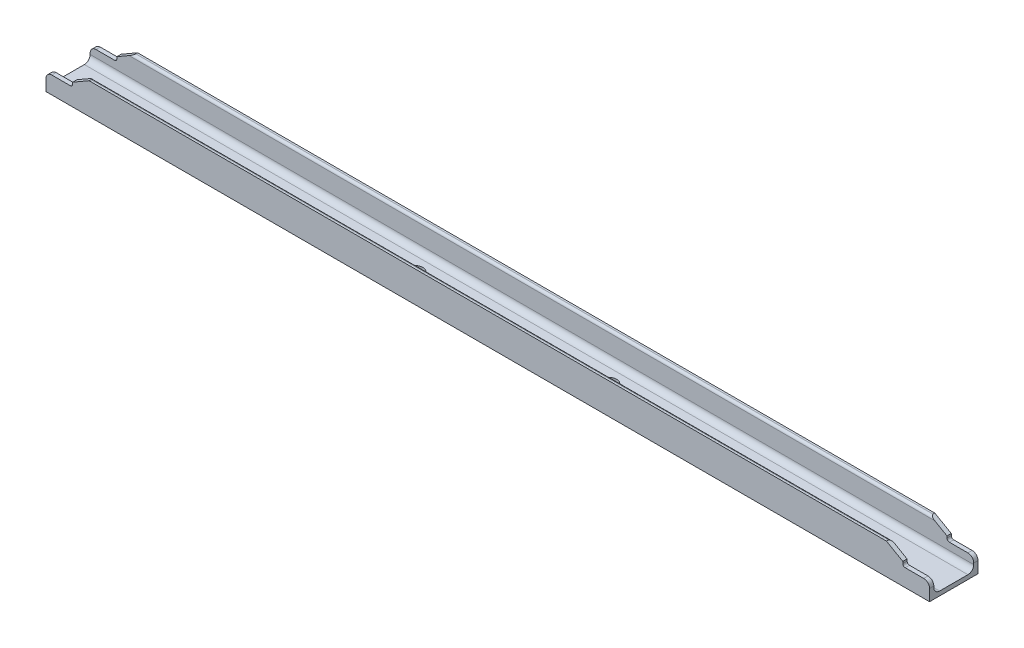
ISO-10303-21;
HEADER;
FILE_DESCRIPTION(('STEP AP214'),'2;1');
FILE_NAME('part.step','',(''),(''),'','','');
FILE_SCHEMA(('AUTOMOTIVE_DESIGN { 1 0 10303 214 1 1 1 1 }'));
ENDSEC;
DATA;
#1=APPLICATION_CONTEXT('core data for automotive mechanical design processes');
#2=APPLICATION_PROTOCOL_DEFINITION('international standard','automotive_design',2000,#1);
#3=PRODUCT_CONTEXT('',#1,'mechanical');
#4=PRODUCT('Part','Part','',(#3));
#5=PRODUCT_RELATED_PRODUCT_CATEGORY('part','',(#4));
#6=PRODUCT_DEFINITION_FORMATION('','',#4);
#7=PRODUCT_DEFINITION_CONTEXT('part definition',#1,'design');
#8=PRODUCT_DEFINITION('design','',#6,#7);
#9=PRODUCT_DEFINITION_SHAPE('','',#8);
#10=(LENGTH_UNIT() NAMED_UNIT(*) SI_UNIT(.MILLI.,.METRE.));
#11=(NAMED_UNIT(*) PLANE_ANGLE_UNIT() SI_UNIT($,.RADIAN.));
#12=(NAMED_UNIT(*) SI_UNIT($,.STERADIAN.) SOLID_ANGLE_UNIT());
#13=UNCERTAINTY_MEASURE_WITH_UNIT(LENGTH_MEASURE(1.E-05),#10,'distance_accuracy_value','');
#14=(GEOMETRIC_REPRESENTATION_CONTEXT(3) GLOBAL_UNCERTAINTY_ASSIGNED_CONTEXT((#13)) GLOBAL_UNIT_ASSIGNED_CONTEXT((#10,
#11,#12)) REPRESENTATION_CONTEXT('',''));
#15=CARTESIAN_POINT('',(0.,0.,0.));
#16=DIRECTION('',(0.,0.,1.));
#17=DIRECTION('',(1.,0.,0.));
#18=AXIS2_PLACEMENT_3D('',#15,#16,#17);
#19=CARTESIAN_POINT('',(-456.000000000001,-28.15,409.363288318623));
#20=DIRECTION('',(-1.,0.,0.));
#21=DIRECTION('',(0.,0.,1.));
#22=AXIS2_PLACEMENT_3D('',#19,#20,#21);
#23=PLANE('',#22);
#24=DIRECTION('',(0.,-1.,0.));
#25=VECTOR('',#24,1.);
#26=CARTESIAN_POINT('',(-456.000000000001,-39.9900000000004,25.));
#27=LINE('',#26,#25);
#28=CARTESIAN_POINT('',(-456.000000000001,-28.15,25.));
#29=VERTEX_POINT('',#28);
#30=CARTESIAN_POINT('',(-456.000000000001,-39.9900000000004,25.));
#31=VERTEX_POINT('',#30);
#32=EDGE_CURVE('E49',#29,#31,#27,.T.);
#33=ORIENTED_EDGE('',*,*,#32,.F.);
#34=DIRECTION('',(0.,0.,-1.));
#35=VECTOR('',#34,1.);
#36=CARTESIAN_POINT('',(-456.000000000001,-28.15,409.363288318623));
#37=LINE('',#36,#35);
#38=CARTESIAN_POINT('',(-456.000000000001,-28.15,20.6));
#39=VERTEX_POINT('',#38);
#40=EDGE_CURVE('E191',#29,#39,#37,.T.);
#41=ORIENTED_EDGE('',*,*,#40,.T.);
#42=DIRECTION('',(0.,1.,0.));
#43=VECTOR('',#42,1.);
#44=CARTESIAN_POINT('',(-456.000000000001,-10.4900000000004,20.6));
#45=LINE('',#44,#43);
#46=CARTESIAN_POINT('',(-456.000000000001,-29.5900000000004,20.6));
#47=VERTEX_POINT('',#46);
#48=EDGE_CURVE('E121',#47,#39,#45,.T.);
#49=ORIENTED_EDGE('',*,*,#48,.F.);
#50=CARTESIAN_POINT('',(-456.000000000001,-29.5900000000004,14.6));
#51=DIRECTION('',(-1.,0.,0.));
#52=DIRECTION('',(0.,0.,1.));
#53=AXIS2_PLACEMENT_3D('',#50,#51,#52);
#54=CIRCLE('',#53,6.);
#55=CARTESIAN_POINT('',(-456.000000000001,-35.5900000000004,14.6));
#56=VERTEX_POINT('',#55);
#57=EDGE_CURVE('E81',#56,#47,#54,.T.);
#58=ORIENTED_EDGE('',*,*,#57,.F.);
#59=DIRECTION('',(0.,0.,1.));
#60=VECTOR('',#59,1.);
#61=CARTESIAN_POINT('',(-456.000000000001,-35.5900000000004,14.6));
#62=LINE('',#61,#60);
#63=CARTESIAN_POINT('',(-456.000000000001,-35.5900000000004,-14.6));
#64=VERTEX_POINT('',#63);
#65=EDGE_CURVE('E74',#64,#56,#62,.T.);
#66=ORIENTED_EDGE('',*,*,#65,.F.);
#67=CARTESIAN_POINT('',(-456.000000000001,-29.5900000000004,-14.6));
#68=DIRECTION('',(-1.,0.,0.));
#69=DIRECTION('',(0.,0.,1.));
#70=AXIS2_PLACEMENT_3D('',#67,#68,#69);
#71=CIRCLE('',#70,6.);
#72=CARTESIAN_POINT('',(-456.000000000001,-29.5900000000003,-20.6));
#73=VERTEX_POINT('',#72);
#74=EDGE_CURVE('E78',#73,#64,#71,.T.);
#75=ORIENTED_EDGE('',*,*,#74,.F.);
#76=DIRECTION('',(0.,-1.,0.));
#77=VECTOR('',#76,1.);
#78=CARTESIAN_POINT('',(-456.000000000001,-10.4900000000004,-20.6));
#79=LINE('',#78,#77);
#80=CARTESIAN_POINT('',(-456.000000000001,-28.15,-20.6));
#81=VERTEX_POINT('',#80);
#82=EDGE_CURVE('E103',#81,#73,#79,.T.);
#83=ORIENTED_EDGE('',*,*,#82,.F.);
#84=CARTESIAN_POINT('',(-456.000000000001,-28.15,-25.));
#85=VERTEX_POINT('',#84);
#86=EDGE_CURVE('E331',#81,#85,#37,.T.);
#87=ORIENTED_EDGE('',*,*,#86,.T.);
#88=DIRECTION('',(0.,1.,0.));
#89=VECTOR('',#88,1.);
#90=CARTESIAN_POINT('',(-456.000000000001,-39.9900000000004,-25.));
#91=LINE('',#90,#89);
#92=CARTESIAN_POINT('',(-456.000000000001,-39.9900000000004,-25.));
#93=VERTEX_POINT('',#92);
#94=EDGE_CURVE('E57',#93,#85,#91,.T.);
#95=ORIENTED_EDGE('',*,*,#94,.F.);
#96=DIRECTION('',(0.,0.,-1.));
#97=VECTOR('',#96,1.);
#98=CARTESIAN_POINT('',(-456.000000000001,-39.9900000000004,-25.));
#99=LINE('',#98,#97);
#100=EDGE_CURVE('E135',#31,#93,#99,.T.);
#101=ORIENTED_EDGE('',*,*,#100,.F.);
#102=EDGE_LOOP('',(#33,#41,#49,#58,#66,#75,#83,#87,#95,#101));
#103=FACE_BOUND('',#102,.T.);
#104=ADVANCED_FACE('F36',(#103),#23,.T.);
#105=CARTESIAN_POINT('',(-515.363288318624,-39.9900000000004,-25.));
#106=DIRECTION('',(0.,0.,-1.));
#107=DIRECTION('',(-1.,0.,0.));
#108=AXIS2_PLACEMENT_3D('',#105,#106,#107);
#109=PLANE('',#108);
#110=DIRECTION('',(0.866025403784442,0.499999999999995,0.));
#111=VECTOR('',#110,1.);
#112=CARTESIAN_POINT('',(-411.495184118129,-7.99000000000037,-25.));
#113=LINE('',#112,#111);
#114=CARTESIAN_POINT('',(-428.400000000001,-17.7499999999999,-25.));
#115=VERTEX_POINT('',#114);
#116=CARTESIAN_POINT('',(-411.495184118129,-7.99000000000037,-25.));
#117=VERTEX_POINT('',#116);
#118=EDGE_CURVE('E388',#115,#117,#113,.T.);
#119=ORIENTED_EDGE('',*,*,#118,.T.);
#120=DIRECTION('',(1.,0.,0.));
#121=VECTOR('',#120,1.);
#122=CARTESIAN_POINT('',(-515.363288318624,-7.99000000000037,-25.));
#123=LINE('',#122,#121);
#124=CARTESIAN_POINT('',(411.495184118129,-7.99000000000037,-25.));
#125=VERTEX_POINT('',#124);
#126=EDGE_CURVE('E110',#117,#125,#123,.T.);
#127=ORIENTED_EDGE('',*,*,#126,.T.);
#128=DIRECTION('',(-0.866025403784442,0.499999999999995,0.));
#129=VECTOR('',#128,1.);
#130=CARTESIAN_POINT('',(411.495184118129,-7.99000000000037,-25.));
#131=LINE('',#130,#129);
#132=CARTESIAN_POINT('',(428.400000000001,-17.7499999999999,-25.));
#133=VERTEX_POINT('',#132);
#134=EDGE_CURVE('E543',#133,#125,#131,.T.);
#135=ORIENTED_EDGE('',*,*,#134,.F.);
#136=DIRECTION('',(0.,1.,0.));
#137=VECTOR('',#136,1.);
#138=CARTESIAN_POINT('',(428.400000000001,-39.9900000000004,-25.));
#139=LINE('',#138,#137);
#140=CARTESIAN_POINT('',(428.400000000001,-19.6499999999999,-25.));
#141=VERTEX_POINT('',#140);
#142=EDGE_CURVE('E478',#141,#133,#139,.T.);
#143=ORIENTED_EDGE('',*,*,#142,.F.);
#144=CARTESIAN_POINT('',(430.900000000001,-19.6499999999999,-25.));
#145=DIRECTION('',(0.,0.,1.));
#146=DIRECTION('',(1.,0.,0.));
#147=AXIS2_PLACEMENT_3D('',#144,#145,#146);
#148=CIRCLE('',#147,2.5);
#149=CARTESIAN_POINT('',(430.900000000001,-22.1499999999999,-25.));
#150=VERTEX_POINT('',#149);
#151=EDGE_CURVE('E471',#150,#141,#148,.F.);
#152=ORIENTED_EDGE('',*,*,#151,.F.);
#153=DIRECTION('',(-1.,0.,0.));
#154=VECTOR('',#153,1.);
#155=CARTESIAN_POINT('',(515.363288318624,-22.1499999999999,-25.));
#156=LINE('',#155,#154);
#157=CARTESIAN_POINT('',(450.000000000001,-22.1499999999999,-25.));
#158=VERTEX_POINT('',#157);
#159=EDGE_CURVE('E462',#158,#150,#156,.T.);
#160=ORIENTED_EDGE('',*,*,#159,.F.);
#161=CARTESIAN_POINT('',(450.000000000001,-28.1499999999999,-25.));
#162=DIRECTION('',(0.,0.,1.));
#163=DIRECTION('',(1.,0.,0.));
#164=AXIS2_PLACEMENT_3D('',#161,#162,#163);
#165=CIRCLE('',#164,6.);
#166=CARTESIAN_POINT('',(456.000000000001,-28.15,-25.));
#167=VERTEX_POINT('',#166);
#168=EDGE_CURVE('E453',#167,#158,#165,.T.);
#169=ORIENTED_EDGE('',*,*,#168,.F.);
#170=DIRECTION('',(0.,1.,0.));
#171=VECTOR('',#170,1.);
#172=CARTESIAN_POINT('',(456.000000000001,-39.9900000000004,-25.));
#173=LINE('',#172,#171);
#174=CARTESIAN_POINT('',(456.000000000001,-39.9900000000004,-25.));
#175=VERTEX_POINT('',#174);
#176=EDGE_CURVE('E338',#175,#167,#173,.T.);
#177=ORIENTED_EDGE('',*,*,#176,.F.);
#178=DIRECTION('',(1.,0.,0.));
#179=VECTOR('',#178,1.);
#180=CARTESIAN_POINT('',(-515.363288318624,-39.9900000000004,-25.));
#181=LINE('',#180,#179);
#182=EDGE_CURVE('E111',#93,#175,#181,.T.);
#183=ORIENTED_EDGE('',*,*,#182,.F.);
#184=ORIENTED_EDGE('',*,*,#94,.T.);
#185=CARTESIAN_POINT('',(-450.000000000001,-28.1499999999999,-25.));
#186=DIRECTION('',(0.,0.,-1.));
#187=DIRECTION('',(-1.,0.,0.));
#188=AXIS2_PLACEMENT_3D('',#185,#186,#187);
#189=CIRCLE('',#188,6.);
#190=CARTESIAN_POINT('',(-450.000000000001,-22.1499999999999,-25.));
#191=VERTEX_POINT('',#190);
#192=EDGE_CURVE('E198',#85,#191,#189,.T.);
#193=ORIENTED_EDGE('',*,*,#192,.T.);
#194=DIRECTION('',(1.,0.,0.));
#195=VECTOR('',#194,1.);
#196=CARTESIAN_POINT('',(-515.363288318624,-22.1499999999999,-25.));
#197=LINE('',#196,#195);
#198=CARTESIAN_POINT('',(-430.900000000001,-22.1499999999999,-25.));
#199=VERTEX_POINT('',#198);
#200=EDGE_CURVE('E206',#191,#199,#197,.T.);
#201=ORIENTED_EDGE('',*,*,#200,.T.);
#202=CARTESIAN_POINT('',(-430.900000000001,-19.6499999999999,-25.));
#203=DIRECTION('',(0.,0.,-1.));
#204=DIRECTION('',(-1.,0.,0.));
#205=AXIS2_PLACEMENT_3D('',#202,#203,#204);
#206=CIRCLE('',#205,2.5);
#207=CARTESIAN_POINT('',(-428.400000000001,-19.6499999999999,-25.));
#208=VERTEX_POINT('',#207);
#209=EDGE_CURVE('E213',#199,#208,#206,.F.);
#210=ORIENTED_EDGE('',*,*,#209,.T.);
#211=DIRECTION('',(0.,1.,0.));
#212=VECTOR('',#211,1.);
#213=CARTESIAN_POINT('',(-428.400000000001,-39.9900000000004,-25.));
#214=LINE('',#213,#212);
#215=EDGE_CURVE('E222',#208,#115,#214,.T.);
#216=ORIENTED_EDGE('',*,*,#215,.T.);
#217=EDGE_LOOP('',(#119,#127,#135,#143,#152,#160,#169,#177,#183,#184,#193,#201,#210,#216));
#218=FACE_BOUND('',#217,.T.);
#219=ADVANCED_FACE('F325',(#218),#109,.T.);
#220=CARTESIAN_POINT('',(-515.363288318624,-10.4900000000004,-20.6));
#221=DIRECTION('',(0.,0.,1.));
#222=DIRECTION('',(0.,-1.,0.));
#223=AXIS2_PLACEMENT_3D('',#220,#221,#222);
#224=PLANE('',#223);
#225=DIRECTION('',(0.866025403784442,0.499999999999995,0.));
#226=VECTOR('',#225,1.);
#227=CARTESIAN_POINT('',(-490.478794023231,-53.591208440279,-20.6));
#228=LINE('',#227,#226);
#229=CARTESIAN_POINT('',(-428.400000000001,-17.7499999999999,-20.6));
#230=VERTEX_POINT('',#229);
#231=CARTESIAN_POINT('',(-415.825311137051,-10.4900000000004,-20.6));
#232=VERTEX_POINT('',#231);
#233=EDGE_CURVE('E324',#230,#232,#228,.T.);
#234=ORIENTED_EDGE('',*,*,#233,.F.);
#235=DIRECTION('',(0.,-1.,0.));
#236=VECTOR('',#235,1.);
#237=CARTESIAN_POINT('',(-428.400000000001,-10.4900000000004,-20.6));
#238=LINE('',#237,#236);
#239=CARTESIAN_POINT('',(-428.400000000001,-19.6499999999999,-20.6));
#240=VERTEX_POINT('',#239);
#241=EDGE_CURVE('E219',#230,#240,#238,.T.);
#242=ORIENTED_EDGE('',*,*,#241,.T.);
#243=CARTESIAN_POINT('',(-430.900000000001,-19.6499999999999,-20.6));
#244=DIRECTION('',(0.,0.,1.));
#245=DIRECTION('',(0.,-1.,0.));
#246=AXIS2_PLACEMENT_3D('',#243,#244,#245);
#247=CIRCLE('',#246,2.5);
#248=CARTESIAN_POINT('',(-430.900000000001,-22.1499999999999,-20.6));
#249=VERTEX_POINT('',#248);
#250=EDGE_CURVE('E210',#240,#249,#247,.F.);
#251=ORIENTED_EDGE('',*,*,#250,.T.);
#252=DIRECTION('',(-1.,0.,0.));
#253=VECTOR('',#252,1.);
#254=CARTESIAN_POINT('',(-515.363288318624,-22.1499999999999,-20.6));
#255=LINE('',#254,#253);
#256=CARTESIAN_POINT('',(-450.000000000001,-22.1499999999999,-20.6));
#257=VERTEX_POINT('',#256);
#258=EDGE_CURVE('E203',#249,#257,#255,.T.);
#259=ORIENTED_EDGE('',*,*,#258,.T.);
#260=CARTESIAN_POINT('',(-450.000000000001,-28.1499999999999,-20.6));
#261=DIRECTION('',(0.,0.,1.));
#262=DIRECTION('',(0.,-1.,0.));
#263=AXIS2_PLACEMENT_3D('',#260,#261,#262);
#264=CIRCLE('',#263,6.);
#265=EDGE_CURVE('E195',#257,#81,#264,.T.);
#266=ORIENTED_EDGE('',*,*,#265,.T.);
#267=ORIENTED_EDGE('',*,*,#82,.T.);
#268=DIRECTION('',(1.,0.,0.));
#269=VECTOR('',#268,1.);
#270=CARTESIAN_POINT('',(-515.363288318624,-29.5900000000003,-20.6));
#271=LINE('',#270,#269);
#272=CARTESIAN_POINT('',(456.000000000001,-29.5900000000003,-20.6));
#273=VERTEX_POINT('',#272);
#274=EDGE_CURVE('E101',#73,#273,#271,.T.);
#275=ORIENTED_EDGE('',*,*,#274,.T.);
#276=DIRECTION('',(0.,-1.,0.));
#277=VECTOR('',#276,1.);
#278=CARTESIAN_POINT('',(456.000000000001,-10.4900000000004,-20.6));
#279=LINE('',#278,#277);
#280=CARTESIAN_POINT('',(456.000000000001,-28.15,-20.6));
#281=VERTEX_POINT('',#280);
#282=EDGE_CURVE('E370',#281,#273,#279,.T.);
#283=ORIENTED_EDGE('',*,*,#282,.F.);
#284=CARTESIAN_POINT('',(450.000000000001,-28.1499999999999,-20.6));
#285=DIRECTION('',(0.,0.,-1.));
#286=DIRECTION('',(0.,-1.,0.));
#287=AXIS2_PLACEMENT_3D('',#284,#285,#286);
#288=CIRCLE('',#287,6.);
#289=CARTESIAN_POINT('',(450.000000000001,-22.1499999999999,-20.6));
#290=VERTEX_POINT('',#289);
#291=EDGE_CURVE('E450',#290,#281,#288,.T.);
#292=ORIENTED_EDGE('',*,*,#291,.F.);
#293=DIRECTION('',(1.,0.,0.));
#294=VECTOR('',#293,1.);
#295=CARTESIAN_POINT('',(515.363288318624,-22.1499999999999,-20.6));
#296=LINE('',#295,#294);
#297=CARTESIAN_POINT('',(430.900000000001,-22.1499999999999,-20.6));
#298=VERTEX_POINT('',#297);
#299=EDGE_CURVE('E459',#298,#290,#296,.T.);
#300=ORIENTED_EDGE('',*,*,#299,.F.);
#301=CARTESIAN_POINT('',(430.900000000001,-19.6499999999999,-20.6));
#302=DIRECTION('',(0.,0.,-1.));
#303=DIRECTION('',(0.,-1.,0.));
#304=AXIS2_PLACEMENT_3D('',#301,#302,#303);
#305=CIRCLE('',#304,2.5);
#306=CARTESIAN_POINT('',(428.400000000001,-19.6499999999999,-20.6));
#307=VERTEX_POINT('',#306);
#308=EDGE_CURVE('E468',#307,#298,#305,.F.);
#309=ORIENTED_EDGE('',*,*,#308,.F.);
#310=DIRECTION('',(0.,-1.,0.));
#311=VECTOR('',#310,1.);
#312=CARTESIAN_POINT('',(428.400000000001,-10.4900000000004,-20.6));
#313=LINE('',#312,#311);
#314=CARTESIAN_POINT('',(428.400000000001,-17.7499999999999,-20.6));
#315=VERTEX_POINT('',#314);
#316=EDGE_CURVE('E418',#315,#307,#313,.T.);
#317=ORIENTED_EDGE('',*,*,#316,.F.);
#318=DIRECTION('',(-0.866025403784442,0.499999999999995,0.));
#319=VECTOR('',#318,1.);
#320=CARTESIAN_POINT('',(490.478794023231,-53.591208440279,-20.6));
#321=LINE('',#320,#319);
#322=CARTESIAN_POINT('',(415.825311137051,-10.4900000000004,-20.6));
#323=VERTEX_POINT('',#322);
#324=EDGE_CURVE('E414',#315,#323,#321,.T.);
#325=ORIENTED_EDGE('',*,*,#324,.T.);
#326=DIRECTION('',(1.,0.,0.));
#327=VECTOR('',#326,1.);
#328=CARTESIAN_POINT('',(-515.363288318624,-10.4900000000004,-20.6));
#329=LINE('',#328,#327);
#330=EDGE_CURVE('E108',#232,#323,#329,.T.);
#331=ORIENTED_EDGE('',*,*,#330,.F.);
#332=EDGE_LOOP('',(#234,#242,#251,#259,#266,#267,#275,#283,#292,#300,#309,#317,#325,#331));
#333=FACE_BOUND('',#332,.T.);
#334=ADVANCED_FACE('F334',(#333),#224,.T.);
#335=CARTESIAN_POINT('',(-515.363288318624,-10.4900000000004,20.6));
#336=DIRECTION('',(0.,0.,-1.));
#337=DIRECTION('',(0.,1.,0.));
#338=AXIS2_PLACEMENT_3D('',#335,#336,#337);
#339=PLANE('',#338);
#340=DIRECTION('',(-0.866025403784442,-0.499999999999995,0.));
#341=VECTOR('',#340,1.);
#342=CARTESIAN_POINT('',(-490.478794023231,-53.591208440279,20.6));
#343=LINE('',#342,#341);
#344=CARTESIAN_POINT('',(-415.825311137051,-10.4900000000004,20.6));
#345=VERTEX_POINT('',#344);
#346=CARTESIAN_POINT('',(-428.400000000001,-17.7499999999999,20.6));
#347=VERTEX_POINT('',#346);
#348=EDGE_CURVE('E397',#345,#347,#343,.T.);
#349=ORIENTED_EDGE('',*,*,#348,.F.);
#350=DIRECTION('',(1.,0.,0.));
#351=VECTOR('',#350,1.);
#352=CARTESIAN_POINT('',(-515.363288318624,-10.4900000000004,20.6));
#353=LINE('',#352,#351);
#354=CARTESIAN_POINT('',(415.825311137051,-10.4900000000004,20.6));
#355=VERTEX_POINT('',#354);
#356=EDGE_CURVE('E118',#345,#355,#353,.T.);
#357=ORIENTED_EDGE('',*,*,#356,.T.);
#358=DIRECTION('',(0.866025403784442,-0.499999999999995,0.));
#359=VECTOR('',#358,1.);
#360=CARTESIAN_POINT('',(490.478794023231,-53.591208440279,20.6));
#361=LINE('',#360,#359);
#362=CARTESIAN_POINT('',(428.400000000001,-17.7499999999999,20.6));
#363=VERTEX_POINT('',#362);
#364=EDGE_CURVE('E430',#355,#363,#361,.T.);
#365=ORIENTED_EDGE('',*,*,#364,.T.);
#366=DIRECTION('',(0.,1.,0.));
#367=VECTOR('',#366,1.);
#368=CARTESIAN_POINT('',(428.400000000001,-10.4900000000004,20.6));
#369=LINE('',#368,#367);
#370=CARTESIAN_POINT('',(428.400000000001,-19.6499999999999,20.6));
#371=VERTEX_POINT('',#370);
#372=EDGE_CURVE('E474',#371,#363,#369,.T.);
#373=ORIENTED_EDGE('',*,*,#372,.F.);
#374=CARTESIAN_POINT('',(430.900000000001,-19.6499999999999,20.6));
#375=DIRECTION('',(0.,0.,1.));
#376=DIRECTION('',(0.,1.,0.));
#377=AXIS2_PLACEMENT_3D('',#374,#375,#376);
#378=CIRCLE('',#377,2.5);
#379=CARTESIAN_POINT('',(430.900000000001,-22.1499999999999,20.6));
#380=VERTEX_POINT('',#379);
#381=EDGE_CURVE('E465',#380,#371,#378,.F.);
#382=ORIENTED_EDGE('',*,*,#381,.F.);
#383=DIRECTION('',(-1.,0.,0.));
#384=VECTOR('',#383,1.);
#385=CARTESIAN_POINT('',(515.363288318624,-22.1499999999999,20.6));
#386=LINE('',#385,#384);
#387=CARTESIAN_POINT('',(450.000000000001,-22.1499999999999,20.6));
#388=VERTEX_POINT('',#387);
#389=EDGE_CURVE('E456',#388,#380,#386,.T.);
#390=ORIENTED_EDGE('',*,*,#389,.F.);
#391=CARTESIAN_POINT('',(450.000000000001,-28.1499999999999,20.6));
#392=DIRECTION('',(0.,0.,1.));
#393=DIRECTION('',(0.,1.,0.));
#394=AXIS2_PLACEMENT_3D('',#391,#392,#393);
#395=CIRCLE('',#394,6.);
#396=CARTESIAN_POINT('',(456.000000000001,-28.15,20.6));
#397=VERTEX_POINT('',#396);
#398=EDGE_CURVE('E356',#397,#388,#395,.T.);
#399=ORIENTED_EDGE('',*,*,#398,.F.);
#400=DIRECTION('',(0.,1.,0.));
#401=VECTOR('',#400,1.);
#402=CARTESIAN_POINT('',(456.000000000001,-10.4900000000004,20.6));
#403=LINE('',#402,#401);
#404=CARTESIAN_POINT('',(456.000000000001,-29.5900000000004,20.6));
#405=VERTEX_POINT('',#404);
#406=EDGE_CURVE('E352',#405,#397,#403,.T.);
#407=ORIENTED_EDGE('',*,*,#406,.F.);
#408=DIRECTION('',(1.,0.,0.));
#409=VECTOR('',#408,1.);
#410=CARTESIAN_POINT('',(-515.363288318624,-29.5900000000003,20.6));
#411=LINE('',#410,#409);
#412=EDGE_CURVE('E122',#47,#405,#411,.T.);
#413=ORIENTED_EDGE('',*,*,#412,.F.);
#414=ORIENTED_EDGE('',*,*,#48,.T.);
#415=CARTESIAN_POINT('',(-450.000000000001,-28.1499999999999,20.6));
#416=DIRECTION('',(0.,0.,-1.));
#417=DIRECTION('',(0.,1.,0.));
#418=AXIS2_PLACEMENT_3D('',#415,#416,#417);
#419=CIRCLE('',#418,6.);
#420=CARTESIAN_POINT('',(-450.000000000001,-22.1499999999999,20.6));
#421=VERTEX_POINT('',#420);
#422=EDGE_CURVE('E192',#39,#421,#419,.T.);
#423=ORIENTED_EDGE('',*,*,#422,.T.);
#424=DIRECTION('',(1.,0.,0.));
#425=VECTOR('',#424,1.);
#426=CARTESIAN_POINT('',(-515.363288318624,-22.1499999999999,20.6));
#427=LINE('',#426,#425);
#428=CARTESIAN_POINT('',(-430.900000000001,-22.1499999999999,20.6));
#429=VERTEX_POINT('',#428);
#430=EDGE_CURVE('E201',#421,#429,#427,.T.);
#431=ORIENTED_EDGE('',*,*,#430,.T.);
#432=CARTESIAN_POINT('',(-430.900000000001,-19.6499999999999,20.6));
#433=DIRECTION('',(0.,0.,-1.));
#434=DIRECTION('',(0.,1.,0.));
#435=AXIS2_PLACEMENT_3D('',#432,#433,#434);
#436=CIRCLE('',#435,2.5);
#437=CARTESIAN_POINT('',(-428.400000000001,-19.6499999999999,20.6));
#438=VERTEX_POINT('',#437);
#439=EDGE_CURVE('E175',#429,#438,#436,.F.);
#440=ORIENTED_EDGE('',*,*,#439,.T.);
#441=DIRECTION('',(0.,1.,0.));
#442=VECTOR('',#441,1.);
#443=CARTESIAN_POINT('',(-428.400000000001,-10.4900000000004,20.6));
#444=LINE('',#443,#442);
#445=EDGE_CURVE('E216',#438,#347,#444,.T.);
#446=ORIENTED_EDGE('',*,*,#445,.T.);
#447=EDGE_LOOP('',(#349,#357,#365,#373,#382,#390,#399,#407,#413,#414,#423,#431,#440,#446));
#448=FACE_BOUND('',#447,.T.);
#449=ADVANCED_FACE('F349',(#448),#339,.T.);
#450=CARTESIAN_POINT('',(-515.363288318624,-39.9900000000004,25.));
#451=DIRECTION('',(0.,0.,1.));
#452=DIRECTION('',(1.,0.,0.));
#453=AXIS2_PLACEMENT_3D('',#450,#451,#452);
#454=PLANE('',#453);
#455=DIRECTION('',(0.866025403784442,0.499999999999995,0.));
#456=VECTOR('',#455,1.);
#457=CARTESIAN_POINT('',(-411.495184118129,-7.99000000000037,25.));
#458=LINE('',#457,#456);
#459=CARTESIAN_POINT('',(-428.400000000001,-17.7499999999999,25.));
#460=VERTEX_POINT('',#459);
#461=CARTESIAN_POINT('',(-411.495184118129,-7.99000000000037,25.));
#462=VERTEX_POINT('',#461);
#463=EDGE_CURVE('E387',#460,#462,#458,.T.);
#464=ORIENTED_EDGE('',*,*,#463,.F.);
#465=DIRECTION('',(0.,-1.,0.));
#466=VECTOR('',#465,1.);
#467=CARTESIAN_POINT('',(-428.400000000001,-39.9900000000004,25.));
#468=LINE('',#467,#466);
#469=CARTESIAN_POINT('',(-428.400000000001,-19.6499999999999,25.));
#470=VERTEX_POINT('',#469);
#471=EDGE_CURVE('E138',#460,#470,#468,.T.);
#472=ORIENTED_EDGE('',*,*,#471,.T.);
#473=CARTESIAN_POINT('',(-430.900000000001,-19.6499999999999,25.));
#474=DIRECTION('',(0.,0.,1.));
#475=DIRECTION('',(1.,0.,0.));
#476=AXIS2_PLACEMENT_3D('',#473,#474,#475);
#477=CIRCLE('',#476,2.5);
#478=CARTESIAN_POINT('',(-430.900000000001,-22.1499999999999,25.));
#479=VERTEX_POINT('',#478);
#480=EDGE_CURVE('E141',#470,#479,#477,.F.);
#481=ORIENTED_EDGE('',*,*,#480,.T.);
#482=DIRECTION('',(-1.,0.,0.));
#483=VECTOR('',#482,1.);
#484=CARTESIAN_POINT('',(-515.363288318624,-22.1499999999999,25.));
#485=LINE('',#484,#483);
#486=CARTESIAN_POINT('',(-450.000000000001,-22.1499999999999,25.));
#487=VERTEX_POINT('',#486);
#488=EDGE_CURVE('E43',#479,#487,#485,.T.);
#489=ORIENTED_EDGE('',*,*,#488,.T.);
#490=CARTESIAN_POINT('',(-450.000000000001,-28.1499999999999,25.));
#491=DIRECTION('',(0.,0.,1.));
#492=DIRECTION('',(1.,0.,0.));
#493=AXIS2_PLACEMENT_3D('',#490,#491,#492);
#494=CIRCLE('',#493,6.);
#495=EDGE_CURVE('E11',#487,#29,#494,.T.);
#496=ORIENTED_EDGE('',*,*,#495,.T.);
#497=ORIENTED_EDGE('',*,*,#32,.T.);
#498=DIRECTION('',(1.,0.,0.));
#499=VECTOR('',#498,1.);
#500=CARTESIAN_POINT('',(-515.363288318624,-39.9900000000004,25.));
#501=LINE('',#500,#499);
#502=CARTESIAN_POINT('',(456.000000000001,-39.9900000000004,25.));
#503=VERTEX_POINT('',#502);
#504=EDGE_CURVE('E136',#31,#503,#501,.T.);
#505=ORIENTED_EDGE('',*,*,#504,.T.);
#506=DIRECTION('',(0.,-1.,0.));
#507=VECTOR('',#506,1.);
#508=CARTESIAN_POINT('',(456.000000000001,-39.9900000000004,25.));
#509=LINE('',#508,#507);
#510=CARTESIAN_POINT('',(456.000000000001,-28.15,25.));
#511=VERTEX_POINT('',#510);
#512=EDGE_CURVE('E360',#511,#503,#509,.T.);
#513=ORIENTED_EDGE('',*,*,#512,.F.);
#514=CARTESIAN_POINT('',(450.000000000001,-28.1499999999999,25.));
#515=DIRECTION('',(0.,0.,-1.));
#516=DIRECTION('',(-1.,0.,0.));
#517=AXIS2_PLACEMENT_3D('',#514,#515,#516);
#518=CIRCLE('',#517,6.);
#519=CARTESIAN_POINT('',(450.000000000001,-22.1499999999999,25.));
#520=VERTEX_POINT('',#519);
#521=EDGE_CURVE('E384',#520,#511,#518,.T.);
#522=ORIENTED_EDGE('',*,*,#521,.F.);
#523=DIRECTION('',(1.,0.,0.));
#524=VECTOR('',#523,1.);
#525=CARTESIAN_POINT('',(515.363288318624,-22.1499999999999,25.));
#526=LINE('',#525,#524);
#527=CARTESIAN_POINT('',(430.900000000001,-22.1499999999999,25.));
#528=VERTEX_POINT('',#527);
#529=EDGE_CURVE('E381',#528,#520,#526,.T.);
#530=ORIENTED_EDGE('',*,*,#529,.F.);
#531=CARTESIAN_POINT('',(430.900000000001,-19.6499999999999,25.));
#532=DIRECTION('',(0.,0.,-1.));
#533=DIRECTION('',(-1.,0.,0.));
#534=AXIS2_PLACEMENT_3D('',#531,#532,#533);
#535=CIRCLE('',#534,2.5);
#536=CARTESIAN_POINT('',(428.400000000001,-19.6499999999999,25.));
#537=VERTEX_POINT('',#536);
#538=EDGE_CURVE('E378',#537,#528,#535,.F.);
#539=ORIENTED_EDGE('',*,*,#538,.F.);
#540=DIRECTION('',(0.,-1.,0.));
#541=VECTOR('',#540,1.);
#542=CARTESIAN_POINT('',(428.400000000001,-39.9900000000004,25.));
#543=LINE('',#542,#541);
#544=CARTESIAN_POINT('',(428.400000000001,-17.7499999999999,25.));
#545=VERTEX_POINT('',#544);
#546=EDGE_CURVE('E375',#545,#537,#543,.T.);
#547=ORIENTED_EDGE('',*,*,#546,.F.);
#548=DIRECTION('',(-0.866025403784442,0.499999999999995,0.));
#549=VECTOR('',#548,1.);
#550=CARTESIAN_POINT('',(411.495184118129,-7.99000000000037,25.));
#551=LINE('',#550,#549);
#552=CARTESIAN_POINT('',(411.495184118129,-7.99000000000037,25.));
#553=VERTEX_POINT('',#552);
#554=EDGE_CURVE('E549',#545,#553,#551,.T.);
#555=ORIENTED_EDGE('',*,*,#554,.T.);
#556=DIRECTION('',(1.,0.,0.));
#557=VECTOR('',#556,1.);
#558=CARTESIAN_POINT('',(-515.363288318624,-7.99000000000037,25.));
#559=LINE('',#558,#557);
#560=EDGE_CURVE('E112',#462,#553,#559,.T.);
#561=ORIENTED_EDGE('',*,*,#560,.F.);
#562=EDGE_LOOP('',(#464,#472,#481,#489,#496,#497,#505,#513,#522,#530,#539,#547,#555,#561));
#563=FACE_BOUND('',#562,.T.);
#564=ADVANCED_FACE('F147',(#563),#454,.T.);
#565=CARTESIAN_POINT('',(-515.363288318624,-39.9900000000004,-25.));
#566=DIRECTION('',(0.,-1.,0.));
#567=DIRECTION('',(0.,0.,-1.));
#568=AXIS2_PLACEMENT_3D('',#565,#566,#567);
#569=PLANE('',#568);
#570=CARTESIAN_POINT('',(-100.,-39.9900000000004,0.));
#571=DIRECTION('',(0.,1.,0.));
#572=DIRECTION('',(0.,0.,1.));
#573=AXIS2_PLACEMENT_3D('',#570,#571,#572);
#574=CIRCLE('',#573,8.00000000000001);
#575=CARTESIAN_POINT('',(-100.,-39.9900000000004,8.00000000000001));
#576=VERTEX_POINT('',#575);
#577=EDGE_CURVE('E226',#576,#576,#574,.T.);
#578=ORIENTED_EDGE('',*,*,#577,.T.);
#579=EDGE_LOOP('',(#578));
#580=FACE_BOUND('',#579,.T.);
#581=ORIENTED_EDGE('',*,*,#504,.F.);
#582=ORIENTED_EDGE('',*,*,#100,.T.);
#583=ORIENTED_EDGE('',*,*,#182,.T.);
#584=DIRECTION('',(0.,0.,-1.));
#585=VECTOR('',#584,1.);
#586=CARTESIAN_POINT('',(456.000000000001,-39.9900000000004,-25.));
#587=LINE('',#586,#585);
#588=EDGE_CURVE('E374',#503,#175,#587,.T.);
#589=ORIENTED_EDGE('',*,*,#588,.F.);
#590=EDGE_LOOP('',(#581,#582,#583,#589));
#591=FACE_BOUND('',#590,.T.);
#592=CARTESIAN_POINT('',(100.,-39.9900000000004,0.));
#593=DIRECTION('',(0.,-1.,0.));
#594=DIRECTION('',(0.,0.,1.));
#595=AXIS2_PLACEMENT_3D('',#592,#593,#594);
#596=CIRCLE('',#595,8.00000000000001);
#597=CARTESIAN_POINT('',(100.,-39.9900000000004,8.00000000000001));
#598=VERTEX_POINT('',#597);
#599=EDGE_CURVE('E482',#598,#598,#596,.T.);
#600=ORIENTED_EDGE('',*,*,#599,.F.);
#601=EDGE_LOOP('',(#600));
#602=FACE_BOUND('',#601,.T.);
#603=ADVANCED_FACE('F343',(#580,#591,#602),#569,.T.);
#604=CARTESIAN_POINT('',(-515.363288318624,-7.99000000000037,-25.));
#605=DIRECTION('',(0.,1.,0.));
#606=DIRECTION('',(0.,0.,1.));
#607=AXIS2_PLACEMENT_3D('',#604,#605,#606);
#608=PLANE('',#607);
#609=DIRECTION('',(0.,0.,1.));
#610=VECTOR('',#609,1.);
#611=CARTESIAN_POINT('',(-411.495184118129,-7.99000000000037,-25.));
#612=LINE('',#611,#610);
#613=CARTESIAN_POINT('',(-411.495184118129,-7.99000000000037,-23.1));
#614=VERTEX_POINT('',#613);
#615=EDGE_CURVE('E392',#117,#614,#612,.T.);
#616=ORIENTED_EDGE('',*,*,#615,.T.);
#617=DIRECTION('',(1.,0.,0.));
#618=VECTOR('',#617,1.);
#619=CARTESIAN_POINT('',(-515.363288318624,-7.99000000000037,-23.1));
#620=LINE('',#619,#618);
#621=CARTESIAN_POINT('',(411.495184118129,-7.99000000000037,-23.1));
#622=VERTEX_POINT('',#621);
#623=EDGE_CURVE('E128',#614,#622,#620,.T.);
#624=ORIENTED_EDGE('',*,*,#623,.T.);
#625=DIRECTION('',(0.,0.,1.));
#626=VECTOR('',#625,1.);
#627=CARTESIAN_POINT('',(411.495184118129,-7.99000000000037,-25.));
#628=LINE('',#627,#626);
#629=EDGE_CURVE('E552',#125,#622,#628,.T.);
#630=ORIENTED_EDGE('',*,*,#629,.F.);
#631=ORIENTED_EDGE('',*,*,#126,.F.);
#632=EDGE_LOOP('',(#616,#624,#630,#631));
#633=FACE_BOUND('',#632,.T.);
#634=ADVANCED_FACE('F619',(#633),#608,.T.);
#635=CARTESIAN_POINT('',(-515.363288318624,-10.4900000000004,-23.1));
#636=DIRECTION('',(1.,0.,0.));
#637=DIRECTION('',(0.,0.,-1.));
#638=AXIS2_PLACEMENT_3D('',#635,#636,#637);
#639=CYLINDRICAL_SURFACE('',#638,2.5);
#640=CARTESIAN_POINT('',(-415.825311137051,-10.4900000000004,-23.1));
#641=DIRECTION('',(0.499999999999995,-0.866025403784442,0.));
#642=DIRECTION('',(0.866025403784442,0.499999999999995,0.));
#643=AXIS2_PLACEMENT_3D('',#640,#641,#642);
#644=ELLIPSE('',#643,5.00000000000005,2.5);
#645=EDGE_CURVE('E399',#232,#614,#644,.F.);
#646=ORIENTED_EDGE('',*,*,#645,.F.);
#647=ORIENTED_EDGE('',*,*,#330,.T.);
#648=CARTESIAN_POINT('',(415.825311137051,-10.4900000000004,-23.1));
#649=DIRECTION('',(0.499999999999995,0.866025403784442,0.));
#650=DIRECTION('',(-0.866025403784442,0.499999999999995,0.));
#651=AXIS2_PLACEMENT_3D('',#648,#649,#650);
#652=ELLIPSE('',#651,5.00000000000005,2.5);
#653=EDGE_CURVE('E425',#323,#622,#652,.F.);
#654=ORIENTED_EDGE('',*,*,#653,.T.);
#655=ORIENTED_EDGE('',*,*,#623,.F.);
#656=EDGE_LOOP('',(#646,#647,#654,#655));
#657=FACE_BOUND('',#656,.T.);
#658=ADVANCED_FACE('F407',(#657),#639,.T.);
#659=CARTESIAN_POINT('',(-515.363288318624,-29.5900000000004,-14.6));
#660=DIRECTION('',(1.,0.,0.));
#661=DIRECTION('',(0.,0.,-1.));
#662=AXIS2_PLACEMENT_3D('',#659,#660,#661);
#663=CYLINDRICAL_SURFACE('',#662,6.);
#664=ORIENTED_EDGE('',*,*,#274,.F.);
#665=ORIENTED_EDGE('',*,*,#74,.T.);
#666=DIRECTION('',(1.,0.,0.));
#667=VECTOR('',#666,1.);
#668=CARTESIAN_POINT('',(-515.363288318624,-35.5900000000004,-14.6));
#669=LINE('',#668,#667);
#670=CARTESIAN_POINT('',(456.000000000001,-35.5900000000004,-14.6));
#671=VERTEX_POINT('',#670);
#672=EDGE_CURVE('E86',#64,#671,#669,.T.);
#673=ORIENTED_EDGE('',*,*,#672,.T.);
#674=CARTESIAN_POINT('',(456.000000000001,-29.5900000000004,-14.6));
#675=DIRECTION('',(-1.,0.,0.));
#676=DIRECTION('',(0.,0.,1.));
#677=AXIS2_PLACEMENT_3D('',#674,#675,#676);
#678=CIRCLE('',#677,6.);
#679=EDGE_CURVE('E365',#273,#671,#678,.T.);
#680=ORIENTED_EDGE('',*,*,#679,.F.);
#681=EDGE_LOOP('',(#664,#665,#673,#680));
#682=FACE_BOUND('',#681,.T.);
#683=ADVANCED_FACE('F99',(#682),#663,.F.);
#684=CARTESIAN_POINT('',(-515.363288318624,-35.5900000000004,14.6));
#685=DIRECTION('',(0.,1.,0.));
#686=DIRECTION('',(0.,0.,1.));
#687=AXIS2_PLACEMENT_3D('',#684,#685,#686);
#688=PLANE('',#687);
#689=CARTESIAN_POINT('',(-100.,-35.5900000000004,0.));
#690=DIRECTION('',(0.,1.,0.));
#691=DIRECTION('',(0.,0.,1.));
#692=AXIS2_PLACEMENT_3D('',#689,#690,#691);
#693=CIRCLE('',#692,8.00000000000001);
#694=CARTESIAN_POINT('',(-100.,-35.5900000000004,8.00000000000001));
#695=VERTEX_POINT('',#694);
#696=EDGE_CURVE('E225',#695,#695,#693,.T.);
#697=ORIENTED_EDGE('',*,*,#696,.F.);
#698=EDGE_LOOP('',(#697));
#699=FACE_BOUND('',#698,.T.);
#700=ORIENTED_EDGE('',*,*,#672,.F.);
#701=ORIENTED_EDGE('',*,*,#65,.T.);
#702=DIRECTION('',(1.,0.,0.));
#703=VECTOR('',#702,1.);
#704=CARTESIAN_POINT('',(-515.363288318624,-35.5900000000004,14.6));
#705=LINE('',#704,#703);
#706=CARTESIAN_POINT('',(456.000000000001,-35.5900000000004,14.6));
#707=VERTEX_POINT('',#706);
#708=EDGE_CURVE('E85',#56,#707,#705,.T.);
#709=ORIENTED_EDGE('',*,*,#708,.T.);
#710=DIRECTION('',(0.,0.,1.));
#711=VECTOR('',#710,1.);
#712=CARTESIAN_POINT('',(456.000000000001,-35.5900000000004,14.6));
#713=LINE('',#712,#711);
#714=EDGE_CURVE('E94',#671,#707,#713,.T.);
#715=ORIENTED_EDGE('',*,*,#714,.F.);
#716=EDGE_LOOP('',(#700,#701,#709,#715));
#717=FACE_BOUND('',#716,.T.);
#718=CARTESIAN_POINT('',(100.,-35.5900000000004,0.));
#719=DIRECTION('',(0.,-1.,0.));
#720=DIRECTION('',(0.,0.,1.));
#721=AXIS2_PLACEMENT_3D('',#718,#719,#720);
#722=CIRCLE('',#721,8.00000000000001);
#723=CARTESIAN_POINT('',(100.,-35.5900000000004,8.00000000000001));
#724=VERTEX_POINT('',#723);
#725=EDGE_CURVE('E481',#724,#724,#722,.T.);
#726=ORIENTED_EDGE('',*,*,#725,.T.);
#727=EDGE_LOOP('',(#726));
#728=FACE_BOUND('',#727,.T.);
#729=ADVANCED_FACE('F90',(#699,#717,#728),#688,.T.);
#730=CARTESIAN_POINT('',(-515.363288318624,-29.5900000000004,14.6));
#731=DIRECTION('',(1.,0.,0.));
#732=DIRECTION('',(0.,0.,-1.));
#733=AXIS2_PLACEMENT_3D('',#730,#731,#732);
#734=CYLINDRICAL_SURFACE('',#733,6.);
#735=ORIENTED_EDGE('',*,*,#708,.F.);
#736=ORIENTED_EDGE('',*,*,#57,.T.);
#737=ORIENTED_EDGE('',*,*,#412,.T.);
#738=CARTESIAN_POINT('',(456.000000000001,-29.5900000000004,14.6));
#739=DIRECTION('',(-1.,0.,0.));
#740=DIRECTION('',(0.,0.,1.));
#741=AXIS2_PLACEMENT_3D('',#738,#739,#740);
#742=CIRCLE('',#741,6.);
#743=EDGE_CURVE('E243',#707,#405,#742,.T.);
#744=ORIENTED_EDGE('',*,*,#743,.F.);
#745=EDGE_LOOP('',(#735,#736,#737,#744));
#746=FACE_BOUND('',#745,.T.);
#747=ADVANCED_FACE('F236',(#746),#734,.F.);
#748=CARTESIAN_POINT('',(-515.363288318624,-10.4900000000004,23.1));
#749=DIRECTION('',(1.,0.,0.));
#750=DIRECTION('',(0.,0.,-1.));
#751=AXIS2_PLACEMENT_3D('',#748,#749,#750);
#752=CYLINDRICAL_SURFACE('',#751,2.5);
#753=CARTESIAN_POINT('',(-415.825311137051,-10.4900000000004,23.1));
#754=DIRECTION('',(0.499999999999995,-0.866025403784442,0.));
#755=DIRECTION('',(0.866025403784442,0.499999999999995,0.));
#756=AXIS2_PLACEMENT_3D('',#753,#754,#755);
#757=ELLIPSE('',#756,5.00000000000005,2.5);
#758=CARTESIAN_POINT('',(-411.495184118129,-7.99000000000037,23.1));
#759=VERTEX_POINT('',#758);
#760=EDGE_CURVE('E395',#759,#345,#757,.F.);
#761=ORIENTED_EDGE('',*,*,#760,.F.);
#762=DIRECTION('',(1.,0.,0.));
#763=VECTOR('',#762,1.);
#764=CARTESIAN_POINT('',(-515.363288318624,-7.99000000000037,23.1));
#765=LINE('',#764,#763);
#766=CARTESIAN_POINT('',(411.495184118129,-7.99000000000037,23.1));
#767=VERTEX_POINT('',#766);
#768=EDGE_CURVE('E115',#759,#767,#765,.T.);
#769=ORIENTED_EDGE('',*,*,#768,.T.);
#770=CARTESIAN_POINT('',(415.825311137051,-10.4900000000004,23.1));
#771=DIRECTION('',(0.499999999999995,0.866025403784442,0.));
#772=DIRECTION('',(-0.866025403784442,0.499999999999995,0.));
#773=AXIS2_PLACEMENT_3D('',#770,#771,#772);
#774=ELLIPSE('',#773,5.00000000000005,2.5);
#775=EDGE_CURVE('E557',#767,#355,#774,.F.);
#776=ORIENTED_EDGE('',*,*,#775,.T.);
#777=ORIENTED_EDGE('',*,*,#356,.F.);
#778=EDGE_LOOP('',(#761,#769,#776,#777));
#779=FACE_BOUND('',#778,.T.);
#780=ADVANCED_FACE('F639',(#779),#752,.T.);
#781=CARTESIAN_POINT('',(-515.363288318624,-7.99000000000037,25.));
#782=DIRECTION('',(0.,1.,0.));
#783=DIRECTION('',(0.,0.,1.));
#784=AXIS2_PLACEMENT_3D('',#781,#782,#783);
#785=PLANE('',#784);
#786=EDGE_CURVE('E390',#759,#462,#612,.T.);
#787=ORIENTED_EDGE('',*,*,#786,.T.);
#788=ORIENTED_EDGE('',*,*,#560,.T.);
#789=EDGE_CURVE('E548',#767,#553,#628,.T.);
#790=ORIENTED_EDGE('',*,*,#789,.F.);
#791=ORIENTED_EDGE('',*,*,#768,.F.);
#792=EDGE_LOOP('',(#787,#788,#790,#791));
#793=FACE_BOUND('',#792,.T.);
#794=ADVANCED_FACE('F590',(#793),#785,.T.);
#795=CARTESIAN_POINT('',(-100.,-39.9900000000004,0.));
#796=DIRECTION('',(0.,1.,0.));
#797=DIRECTION('',(0.,0.,1.));
#798=AXIS2_PLACEMENT_3D('',#795,#796,#797);
#799=CYLINDRICAL_SURFACE('',#798,8.00000000000001);
#800=ORIENTED_EDGE('',*,*,#577,.F.);
#801=EDGE_LOOP('',(#800));
#802=FACE_BOUND('',#801,.T.);
#803=ORIENTED_EDGE('',*,*,#696,.T.);
#804=EDGE_LOOP('',(#803));
#805=FACE_BOUND('',#804,.T.);
#806=ADVANCED_FACE('F598',(#802,#805),#799,.F.);
#807=CARTESIAN_POINT('',(-450.000000000001,-28.1499999999999,409.363288318623));
#808=DIRECTION('',(0.,0.,-1.));
#809=DIRECTION('',(-1.,0.,0.));
#810=AXIS2_PLACEMENT_3D('',#807,#808,#809);
#811=CYLINDRICAL_SURFACE('',#810,6.);
#812=ORIENTED_EDGE('',*,*,#40,.F.);
#813=ORIENTED_EDGE('',*,*,#495,.F.);
#814=DIRECTION('',(0.,0.,-1.));
#815=VECTOR('',#814,1.);
#816=CARTESIAN_POINT('',(-450.000000000001,-22.1499999999999,409.363288318623));
#817=LINE('',#816,#815);
#818=EDGE_CURVE('E165',#487,#421,#817,.T.);
#819=ORIENTED_EDGE('',*,*,#818,.T.);
#820=ORIENTED_EDGE('',*,*,#422,.F.);
#821=EDGE_LOOP('',(#812,#813,#819,#820));
#822=FACE_BOUND('',#821,.T.);
#823=ADVANCED_FACE('F596',(#822),#811,.T.);
#824=CARTESIAN_POINT('',(-430.900000000001,-22.1499999999999,409.363288318623));
#825=DIRECTION('',(0.,1.,0.));
#826=DIRECTION('',(-1.,0.,0.));
#827=AXIS2_PLACEMENT_3D('',#824,#825,#826);
#828=PLANE('',#827);
#829=ORIENTED_EDGE('',*,*,#818,.F.);
#830=ORIENTED_EDGE('',*,*,#488,.F.);
#831=DIRECTION('',(0.,0.,-1.));
#832=VECTOR('',#831,1.);
#833=CARTESIAN_POINT('',(-430.900000000001,-22.1499999999999,409.363288318623));
#834=LINE('',#833,#832);
#835=EDGE_CURVE('E162',#479,#429,#834,.T.);
#836=ORIENTED_EDGE('',*,*,#835,.T.);
#837=ORIENTED_EDGE('',*,*,#430,.F.);
#838=EDGE_LOOP('',(#829,#830,#836,#837));
#839=FACE_BOUND('',#838,.T.);
#840=ADVANCED_FACE('F159',(#839),#828,.T.);
#841=CARTESIAN_POINT('',(-430.900000000001,-19.6499999999999,409.363288318623));
#842=DIRECTION('',(0.,0.,-1.));
#843=DIRECTION('',(-1.,0.,0.));
#844=AXIS2_PLACEMENT_3D('',#841,#842,#843);
#845=CYLINDRICAL_SURFACE('',#844,2.5);
#846=ORIENTED_EDGE('',*,*,#835,.F.);
#847=ORIENTED_EDGE('',*,*,#480,.F.);
#848=DIRECTION('',(0.,0.,-1.));
#849=VECTOR('',#848,1.);
#850=CARTESIAN_POINT('',(-428.400000000001,-19.6499999999999,409.363288318623));
#851=LINE('',#850,#849);
#852=EDGE_CURVE('E182',#470,#438,#851,.T.);
#853=ORIENTED_EDGE('',*,*,#852,.T.);
#854=ORIENTED_EDGE('',*,*,#439,.F.);
#855=EDGE_LOOP('',(#846,#847,#853,#854));
#856=FACE_BOUND('',#855,.T.);
#857=ADVANCED_FACE('F170',(#856),#845,.F.);
#858=CARTESIAN_POINT('',(-428.400000000001,-17.7499999999999,409.363288318623));
#859=DIRECTION('',(-1.,0.,0.));
#860=DIRECTION('',(0.,0.,1.));
#861=AXIS2_PLACEMENT_3D('',#858,#859,#860);
#862=PLANE('',#861);
#863=ORIENTED_EDGE('',*,*,#852,.F.);
#864=ORIENTED_EDGE('',*,*,#471,.F.);
#865=DIRECTION('',(0.,0.,-1.));
#866=VECTOR('',#865,1.);
#867=CARTESIAN_POINT('',(-428.400000000001,-17.7499999999999,409.363288318623));
#868=LINE('',#867,#866);
#869=EDGE_CURVE('E190',#460,#347,#868,.T.);
#870=ORIENTED_EDGE('',*,*,#869,.T.);
#871=ORIENTED_EDGE('',*,*,#445,.F.);
#872=EDGE_LOOP('',(#863,#864,#870,#871));
#873=FACE_BOUND('',#872,.T.);
#874=ADVANCED_FACE('F595',(#873),#862,.T.);
#875=EDGE_CURVE('E184',#240,#208,#851,.T.);
#876=ORIENTED_EDGE('',*,*,#875,.F.);
#877=ORIENTED_EDGE('',*,*,#241,.F.);
#878=EDGE_CURVE('E187',#230,#115,#868,.T.);
#879=ORIENTED_EDGE('',*,*,#878,.T.);
#880=ORIENTED_EDGE('',*,*,#215,.F.);
#881=EDGE_LOOP('',(#876,#877,#879,#880));
#882=FACE_BOUND('',#881,.T.);
#883=ADVANCED_FACE('F319',(#882),#862,.T.);
#884=EDGE_CURVE('E177',#249,#199,#834,.T.);
#885=ORIENTED_EDGE('',*,*,#884,.F.);
#886=ORIENTED_EDGE('',*,*,#250,.F.);
#887=ORIENTED_EDGE('',*,*,#875,.T.);
#888=ORIENTED_EDGE('',*,*,#209,.F.);
#889=EDGE_LOOP('',(#885,#886,#887,#888));
#890=FACE_BOUND('',#889,.T.);
#891=ADVANCED_FACE('F323',(#890),#845,.F.);
#892=EDGE_CURVE('E176',#257,#191,#817,.T.);
#893=ORIENTED_EDGE('',*,*,#892,.F.);
#894=ORIENTED_EDGE('',*,*,#258,.F.);
#895=ORIENTED_EDGE('',*,*,#884,.T.);
#896=ORIENTED_EDGE('',*,*,#200,.F.);
#897=EDGE_LOOP('',(#893,#894,#895,#896));
#898=FACE_BOUND('',#897,.T.);
#899=ADVANCED_FACE('F328',(#898),#828,.T.);
#900=ORIENTED_EDGE('',*,*,#86,.F.);
#901=ORIENTED_EDGE('',*,*,#265,.F.);
#902=ORIENTED_EDGE('',*,*,#892,.T.);
#903=ORIENTED_EDGE('',*,*,#192,.F.);
#904=EDGE_LOOP('',(#900,#901,#902,#903));
#905=FACE_BOUND('',#904,.T.);
#906=ADVANCED_FACE('F330',(#905),#811,.T.);
#907=CARTESIAN_POINT('',(-411.495184118129,-7.99000000000037,-25.));
#908=DIRECTION('',(0.499999999999995,-0.866025403784442,0.));
#909=DIRECTION('',(0.866025403784442,0.499999999999995,0.));
#910=AXIS2_PLACEMENT_3D('',#907,#908,#909);
#911=PLANE('',#910);
#912=ORIENTED_EDGE('',*,*,#233,.T.);
#913=ORIENTED_EDGE('',*,*,#645,.T.);
#914=ORIENTED_EDGE('',*,*,#615,.F.);
#915=ORIENTED_EDGE('',*,*,#118,.F.);
#916=ORIENTED_EDGE('',*,*,#878,.F.);
#917=EDGE_LOOP('',(#912,#913,#914,#915,#916));
#918=FACE_BOUND('',#917,.T.);
#919=ADVANCED_FACE('F403',(#918),#911,.F.);
#920=ORIENTED_EDGE('',*,*,#348,.T.);
#921=ORIENTED_EDGE('',*,*,#869,.F.);
#922=ORIENTED_EDGE('',*,*,#463,.T.);
#923=ORIENTED_EDGE('',*,*,#786,.F.);
#924=ORIENTED_EDGE('',*,*,#760,.T.);
#925=EDGE_LOOP('',(#920,#921,#922,#923,#924));
#926=FACE_BOUND('',#925,.T.);
#927=ADVANCED_FACE('F694',(#926),#911,.F.);
#928=CARTESIAN_POINT('',(456.000000000001,-28.15,409.363288318623));
#929=DIRECTION('',(1.,0.,0.));
#930=DIRECTION('',(0.,0.,1.));
#931=AXIS2_PLACEMENT_3D('',#928,#929,#930);
#932=PLANE('',#931);
#933=ORIENTED_EDGE('',*,*,#512,.T.);
#934=ORIENTED_EDGE('',*,*,#588,.T.);
#935=ORIENTED_EDGE('',*,*,#176,.T.);
#936=DIRECTION('',(0.,0.,-1.));
#937=VECTOR('',#936,1.);
#938=CARTESIAN_POINT('',(456.000000000001,-28.15,409.363288318623));
#939=LINE('',#938,#937);
#940=EDGE_CURVE('E434',#281,#167,#939,.T.);
#941=ORIENTED_EDGE('',*,*,#940,.F.);
#942=ORIENTED_EDGE('',*,*,#282,.T.);
#943=ORIENTED_EDGE('',*,*,#679,.T.);
#944=ORIENTED_EDGE('',*,*,#714,.T.);
#945=ORIENTED_EDGE('',*,*,#743,.T.);
#946=ORIENTED_EDGE('',*,*,#406,.T.);
#947=EDGE_CURVE('E436',#511,#397,#939,.T.);
#948=ORIENTED_EDGE('',*,*,#947,.F.);
#949=EDGE_LOOP('',(#933,#934,#935,#941,#942,#943,#944,#945,#946,#948));
#950=FACE_BOUND('',#949,.T.);
#951=ADVANCED_FACE('F363',(#950),#932,.T.);
#952=CARTESIAN_POINT('',(100.,-39.9900000000004,0.));
#953=DIRECTION('',(0.,1.,0.));
#954=DIRECTION('',(0.,0.,1.));
#955=AXIS2_PLACEMENT_3D('',#952,#953,#954);
#956=CYLINDRICAL_SURFACE('',#955,8.00000000000001);
#957=ORIENTED_EDGE('',*,*,#599,.T.);
#958=EDGE_LOOP('',(#957));
#959=FACE_BOUND('',#958,.T.);
#960=ORIENTED_EDGE('',*,*,#725,.F.);
#961=EDGE_LOOP('',(#960));
#962=FACE_BOUND('',#961,.T.);
#963=ADVANCED_FACE('F693',(#959,#962),#956,.F.);
#964=CARTESIAN_POINT('',(450.000000000001,-28.1499999999999,409.363288318623));
#965=DIRECTION('',(0.,0.,-1.));
#966=DIRECTION('',(1.,0.,0.));
#967=AXIS2_PLACEMENT_3D('',#964,#965,#966);
#968=CYLINDRICAL_SURFACE('',#967,6.);
#969=ORIENTED_EDGE('',*,*,#947,.T.);
#970=ORIENTED_EDGE('',*,*,#398,.T.);
#971=DIRECTION('',(0.,0.,-1.));
#972=VECTOR('',#971,1.);
#973=CARTESIAN_POINT('',(450.000000000001,-22.1499999999999,409.363288318623));
#974=LINE('',#973,#972);
#975=EDGE_CURVE('E437',#520,#388,#974,.T.);
#976=ORIENTED_EDGE('',*,*,#975,.F.);
#977=ORIENTED_EDGE('',*,*,#521,.T.);
#978=EDGE_LOOP('',(#969,#970,#976,#977));
#979=FACE_BOUND('',#978,.T.);
#980=ADVANCED_FACE('F704',(#979),#968,.T.);
#981=CARTESIAN_POINT('',(430.900000000001,-22.1499999999999,409.363288318623));
#982=DIRECTION('',(0.,1.,0.));
#983=DIRECTION('',(1.,0.,0.));
#984=AXIS2_PLACEMENT_3D('',#981,#982,#983);
#985=PLANE('',#984);
#986=ORIENTED_EDGE('',*,*,#975,.T.);
#987=ORIENTED_EDGE('',*,*,#389,.T.);
#988=DIRECTION('',(0.,0.,-1.));
#989=VECTOR('',#988,1.);
#990=CARTESIAN_POINT('',(430.900000000001,-22.1499999999999,409.363288318623));
#991=LINE('',#990,#989);
#992=EDGE_CURVE('E442',#528,#380,#991,.T.);
#993=ORIENTED_EDGE('',*,*,#992,.F.);
#994=ORIENTED_EDGE('',*,*,#529,.T.);
#995=EDGE_LOOP('',(#986,#987,#993,#994));
#996=FACE_BOUND('',#995,.T.);
#997=ADVANCED_FACE('F715',(#996),#985,.T.);
#998=CARTESIAN_POINT('',(430.900000000001,-19.6499999999999,409.363288318623));
#999=DIRECTION('',(0.,0.,-1.));
#1000=DIRECTION('',(1.,0.,0.));
#1001=AXIS2_PLACEMENT_3D('',#998,#999,#1000);
#1002=CYLINDRICAL_SURFACE('',#1001,2.5);
#1003=ORIENTED_EDGE('',*,*,#992,.T.);
#1004=ORIENTED_EDGE('',*,*,#381,.T.);
#1005=DIRECTION('',(0.,0.,-1.));
#1006=VECTOR('',#1005,1.);
#1007=CARTESIAN_POINT('',(428.400000000001,-19.6499999999999,409.363288318623));
#1008=LINE('',#1007,#1006);
#1009=EDGE_CURVE('E428',#537,#371,#1008,.T.);
#1010=ORIENTED_EDGE('',*,*,#1009,.F.);
#1011=ORIENTED_EDGE('',*,*,#538,.T.);
#1012=EDGE_LOOP('',(#1003,#1004,#1010,#1011));
#1013=FACE_BOUND('',#1012,.T.);
#1014=ADVANCED_FACE('F726',(#1013),#1002,.F.);
#1015=CARTESIAN_POINT('',(428.400000000001,-17.7499999999999,409.363288318623));
#1016=DIRECTION('',(1.,0.,0.));
#1017=DIRECTION('',(0.,0.,1.));
#1018=AXIS2_PLACEMENT_3D('',#1015,#1016,#1017);
#1019=PLANE('',#1018);
#1020=ORIENTED_EDGE('',*,*,#1009,.T.);
#1021=ORIENTED_EDGE('',*,*,#372,.T.);
#1022=DIRECTION('',(0.,0.,-1.));
#1023=VECTOR('',#1022,1.);
#1024=CARTESIAN_POINT('',(428.400000000001,-17.7499999999999,409.363288318623));
#1025=LINE('',#1024,#1023);
#1026=EDGE_CURVE('E448',#545,#363,#1025,.T.);
#1027=ORIENTED_EDGE('',*,*,#1026,.F.);
#1028=ORIENTED_EDGE('',*,*,#546,.T.);
#1029=EDGE_LOOP('',(#1020,#1021,#1027,#1028));
#1030=FACE_BOUND('',#1029,.T.);
#1031=ADVANCED_FACE('F583',(#1030),#1019,.T.);
#1032=EDGE_CURVE('E424',#307,#141,#1008,.T.);
#1033=ORIENTED_EDGE('',*,*,#1032,.T.);
#1034=ORIENTED_EDGE('',*,*,#142,.T.);
#1035=EDGE_CURVE('E446',#315,#133,#1025,.T.);
#1036=ORIENTED_EDGE('',*,*,#1035,.F.);
#1037=ORIENTED_EDGE('',*,*,#316,.T.);
#1038=EDGE_LOOP('',(#1033,#1034,#1036,#1037));
#1039=FACE_BOUND('',#1038,.T.);
#1040=ADVANCED_FACE('F534',(#1039),#1019,.T.);
#1041=EDGE_CURVE('E439',#298,#150,#991,.T.);
#1042=ORIENTED_EDGE('',*,*,#1041,.T.);
#1043=ORIENTED_EDGE('',*,*,#151,.T.);
#1044=ORIENTED_EDGE('',*,*,#1032,.F.);
#1045=ORIENTED_EDGE('',*,*,#308,.T.);
#1046=EDGE_LOOP('',(#1042,#1043,#1044,#1045));
#1047=FACE_BOUND('',#1046,.T.);
#1048=ADVANCED_FACE('F540',(#1047),#1002,.F.);
#1049=EDGE_CURVE('E443',#290,#158,#974,.T.);
#1050=ORIENTED_EDGE('',*,*,#1049,.T.);
#1051=ORIENTED_EDGE('',*,*,#159,.T.);
#1052=ORIENTED_EDGE('',*,*,#1041,.F.);
#1053=ORIENTED_EDGE('',*,*,#299,.T.);
#1054=EDGE_LOOP('',(#1050,#1051,#1052,#1053));
#1055=FACE_BOUND('',#1054,.T.);
#1056=ADVANCED_FACE('F729',(#1055),#985,.T.);
#1057=ORIENTED_EDGE('',*,*,#940,.T.);
#1058=ORIENTED_EDGE('',*,*,#168,.T.);
#1059=ORIENTED_EDGE('',*,*,#1049,.F.);
#1060=ORIENTED_EDGE('',*,*,#291,.T.);
#1061=EDGE_LOOP('',(#1057,#1058,#1059,#1060));
#1062=FACE_BOUND('',#1061,.T.);
#1063=ADVANCED_FACE('F717',(#1062),#968,.T.);
#1064=CARTESIAN_POINT('',(411.495184118129,-7.99000000000037,-25.));
#1065=DIRECTION('',(-0.499999999999995,-0.866025403784442,0.));
#1066=DIRECTION('',(-0.866025403784442,0.499999999999995,0.));
#1067=AXIS2_PLACEMENT_3D('',#1064,#1065,#1066);
#1068=PLANE('',#1067);
#1069=ORIENTED_EDGE('',*,*,#324,.F.);
#1070=ORIENTED_EDGE('',*,*,#1035,.T.);
#1071=ORIENTED_EDGE('',*,*,#134,.T.);
#1072=ORIENTED_EDGE('',*,*,#629,.T.);
#1073=ORIENTED_EDGE('',*,*,#653,.F.);
#1074=EDGE_LOOP('',(#1069,#1070,#1071,#1072,#1073));
#1075=FACE_BOUND('',#1074,.T.);
#1076=ADVANCED_FACE('F782',(#1075),#1068,.F.);
#1077=ORIENTED_EDGE('',*,*,#364,.F.);
#1078=ORIENTED_EDGE('',*,*,#775,.F.);
#1079=ORIENTED_EDGE('',*,*,#789,.T.);
#1080=ORIENTED_EDGE('',*,*,#554,.F.);
#1081=ORIENTED_EDGE('',*,*,#1026,.T.);
#1082=EDGE_LOOP('',(#1077,#1078,#1079,#1080,#1081));
#1083=FACE_BOUND('',#1082,.T.);
#1084=ADVANCED_FACE('F567',(#1083),#1068,.F.);
#1085=CLOSED_SHELL('',(#104,#219,#334,#449,#564,#603,#634,#658,#683,#729,#747,#780,#794,#806,
#823,#840,#857,#874,#883,#891,#899,#906,#919,#927,#951,#963,#980,#997,#1014,#1031,#1040,#1048,
#1056,#1063,#1076,#1084));
#1086=MANIFOLD_SOLID_BREP('B2',#1085);
#1087=ADVANCED_BREP_SHAPE_REPRESENTATION('',(#18,#1086),#14);
#1088=SHAPE_DEFINITION_REPRESENTATION(#9,#1087);
ENDSEC;
END-ISO-10303-21;
